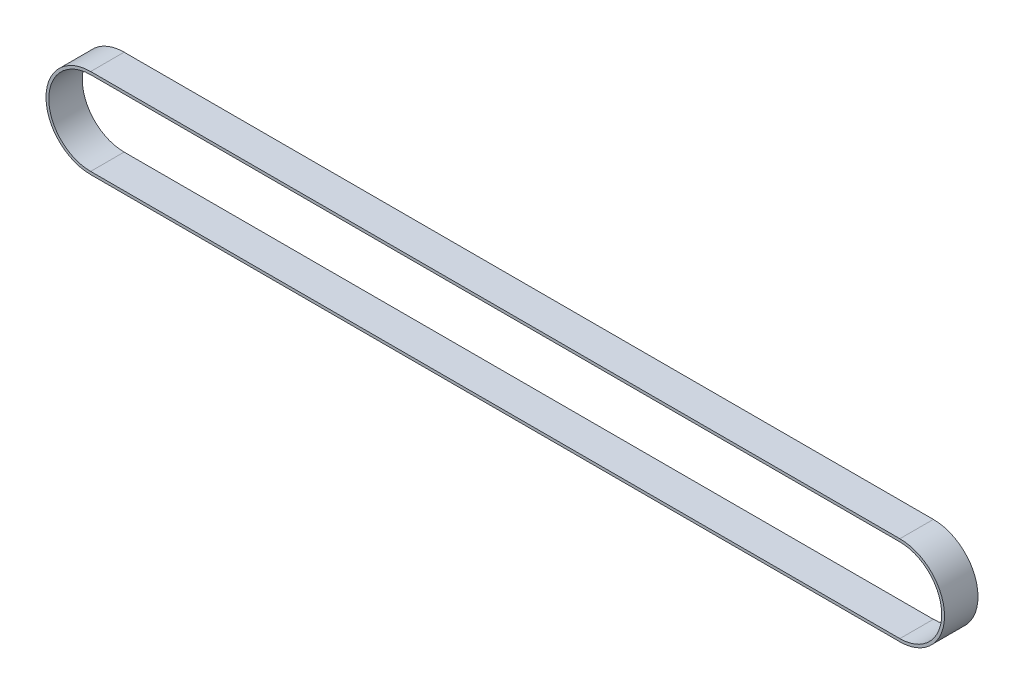
ISO-10303-21;
HEADER;
FILE_DESCRIPTION(('STEP AP214'),'2;1');
FILE_NAME('part.step','',(''),(''),'','','');
FILE_SCHEMA(('AUTOMOTIVE_DESIGN { 1 0 10303 214 1 1 1 1 }'));
ENDSEC;
DATA;
#1=APPLICATION_CONTEXT('core data for automotive mechanical design processes');
#2=APPLICATION_PROTOCOL_DEFINITION('international standard','automotive_design',2000,#1);
#3=PRODUCT_CONTEXT('',#1,'mechanical');
#4=PRODUCT('Part','Part','',(#3));
#5=PRODUCT_RELATED_PRODUCT_CATEGORY('part','',(#4));
#6=PRODUCT_DEFINITION_FORMATION('','',#4);
#7=PRODUCT_DEFINITION_CONTEXT('part definition',#1,'design');
#8=PRODUCT_DEFINITION('design','',#6,#7);
#9=PRODUCT_DEFINITION_SHAPE('','',#8);
#10=(LENGTH_UNIT() NAMED_UNIT(*) SI_UNIT(.MILLI.,.METRE.));
#11=(NAMED_UNIT(*) PLANE_ANGLE_UNIT() SI_UNIT($,.RADIAN.));
#12=(NAMED_UNIT(*) SI_UNIT($,.STERADIAN.) SOLID_ANGLE_UNIT());
#13=UNCERTAINTY_MEASURE_WITH_UNIT(LENGTH_MEASURE(1.E-05),#10,'distance_accuracy_value','');
#14=(GEOMETRIC_REPRESENTATION_CONTEXT(3) GLOBAL_UNCERTAINTY_ASSIGNED_CONTEXT((#13)) GLOBAL_UNIT_ASSIGNED_CONTEXT((#10,
#11,#12)) REPRESENTATION_CONTEXT('',''));
#15=CARTESIAN_POINT('',(0.,0.,0.));
#16=DIRECTION('',(0.,0.,1.));
#17=DIRECTION('',(1.,0.,0.));
#18=AXIS2_PLACEMENT_3D('',#15,#16,#17);
#19=CARTESIAN_POINT('',(0.,-0.500000000000014,-6.5));
#20=DIRECTION('',(0.,0.,1.));
#21=DIRECTION('',(1.,0.,0.));
#22=AXIS2_PLACEMENT_3D('',#19,#20,#21);
#23=CYLINDRICAL_SURFACE('',#22,8.);
#24=CARTESIAN_POINT('',(0.,-0.500000000000014,-0.5));
#25=DIRECTION('',(0.,0.,-1.));
#26=DIRECTION('',(-1.,0.,0.));
#27=AXIS2_PLACEMENT_3D('',#24,#25,#26);
#28=CIRCLE('',#27,8.);
#29=CARTESIAN_POINT('',(0.,7.49999999999999,-0.5));
#30=VERTEX_POINT('',#29);
#31=CARTESIAN_POINT('',(0.,-8.50000000000001,-0.5));
#32=VERTEX_POINT('',#31);
#33=EDGE_CURVE('E155',#30,#32,#28,.F.);
#34=ORIENTED_EDGE('',*,*,#33,.F.);
#35=DIRECTION('',(0.,0.,1.));
#36=VECTOR('',#35,1.);
#37=CARTESIAN_POINT('',(0.,7.49999999999999,-6.5));
#38=LINE('',#37,#36);
#39=CARTESIAN_POINT('',(0.,7.49999999999999,-6.5));
#40=VERTEX_POINT('',#39);
#41=EDGE_CURVE('E12',#40,#30,#38,.T.);
#42=ORIENTED_EDGE('',*,*,#41,.F.);
#43=CARTESIAN_POINT('',(0.,-0.500000000000014,-6.5));
#44=DIRECTION('',(0.,0.,-1.));
#45=DIRECTION('',(-1.,0.,0.));
#46=AXIS2_PLACEMENT_3D('',#43,#44,#45);
#47=CIRCLE('',#46,8.);
#48=CARTESIAN_POINT('',(0.,-8.50000000000001,-6.5));
#49=VERTEX_POINT('',#48);
#50=EDGE_CURVE('E159',#40,#49,#47,.F.);
#51=ORIENTED_EDGE('',*,*,#50,.T.);
#52=DIRECTION('',(0.,0.,1.));
#53=VECTOR('',#52,1.);
#54=CARTESIAN_POINT('',(0.,-8.50000000000001,-6.5));
#55=LINE('',#54,#53);
#56=EDGE_CURVE('E60',#49,#32,#55,.T.);
#57=ORIENTED_EDGE('',*,*,#56,.T.);
#58=EDGE_LOOP('',(#34,#42,#51,#57));
#59=FACE_BOUND('',#58,.T.);
#60=ADVANCED_FACE('F57',(#59),#23,.T.);
#61=CARTESIAN_POINT('',(0.,7.49999999999999,-6.5));
#62=DIRECTION('',(0.,1.,0.));
#63=DIRECTION('',(-1.,0.,0.));
#64=AXIS2_PLACEMENT_3D('',#61,#62,#63);
#65=PLANE('',#64);
#66=DIRECTION('',(-1.,0.,0.));
#67=VECTOR('',#66,1.);
#68=CARTESIAN_POINT('',(0.,7.49999999999999,-0.5));
#69=LINE('',#68,#67);
#70=CARTESIAN_POINT('',(145.,7.49999999999997,-0.5));
#71=VERTEX_POINT('',#70);
#72=EDGE_CURVE('E163',#71,#30,#69,.T.);
#73=ORIENTED_EDGE('',*,*,#72,.F.);
#74=DIRECTION('',(0.,0.,1.));
#75=VECTOR('',#74,1.);
#76=CARTESIAN_POINT('',(145.,7.49999999999997,-6.5));
#77=LINE('',#76,#75);
#78=CARTESIAN_POINT('',(145.,7.49999999999997,-6.5));
#79=VERTEX_POINT('',#78);
#80=EDGE_CURVE('E65',#79,#71,#77,.T.);
#81=ORIENTED_EDGE('',*,*,#80,.F.);
#82=DIRECTION('',(-1.,0.,0.));
#83=VECTOR('',#82,1.);
#84=CARTESIAN_POINT('',(0.,7.49999999999999,-6.5));
#85=LINE('',#84,#83);
#86=EDGE_CURVE('E169',#79,#40,#85,.T.);
#87=ORIENTED_EDGE('',*,*,#86,.T.);
#88=ORIENTED_EDGE('',*,*,#41,.T.);
#89=EDGE_LOOP('',(#73,#81,#87,#88));
#90=FACE_BOUND('',#89,.T.);
#91=ADVANCED_FACE('F195',(#90),#65,.T.);
#92=CARTESIAN_POINT('',(145.,-0.500000000000028,-6.5));
#93=DIRECTION('',(0.,0.,1.));
#94=DIRECTION('',(1.,0.,0.));
#95=AXIS2_PLACEMENT_3D('',#92,#93,#94);
#96=CYLINDRICAL_SURFACE('',#95,8.);
#97=CARTESIAN_POINT('',(145.,-0.500000000000028,-0.5));
#98=DIRECTION('',(0.,0.,-1.));
#99=DIRECTION('',(-1.,0.,0.));
#100=AXIS2_PLACEMENT_3D('',#97,#98,#99);
#101=CIRCLE('',#100,8.);
#102=CARTESIAN_POINT('',(145.,-8.50000000000003,-0.5));
#103=VERTEX_POINT('',#102);
#104=EDGE_CURVE('E177',#103,#71,#101,.F.);
#105=ORIENTED_EDGE('',*,*,#104,.F.);
#106=DIRECTION('',(0.,0.,1.));
#107=VECTOR('',#106,1.);
#108=CARTESIAN_POINT('',(145.,-8.50000000000003,-6.5));
#109=LINE('',#108,#107);
#110=CARTESIAN_POINT('',(145.,-8.50000000000003,-6.5));
#111=VERTEX_POINT('',#110);
#112=EDGE_CURVE('E182',#111,#103,#109,.T.);
#113=ORIENTED_EDGE('',*,*,#112,.F.);
#114=CARTESIAN_POINT('',(145.,-0.500000000000028,-6.5));
#115=DIRECTION('',(0.,0.,-1.));
#116=DIRECTION('',(-1.,0.,0.));
#117=AXIS2_PLACEMENT_3D('',#114,#115,#116);
#118=CIRCLE('',#117,8.);
#119=EDGE_CURVE('E166',#111,#79,#118,.F.);
#120=ORIENTED_EDGE('',*,*,#119,.T.);
#121=ORIENTED_EDGE('',*,*,#80,.T.);
#122=EDGE_LOOP('',(#105,#113,#120,#121));
#123=FACE_BOUND('',#122,.T.);
#124=ADVANCED_FACE('F199',(#123),#96,.T.);
#125=CARTESIAN_POINT('',(0.,-8.50000000000001,-6.5));
#126=DIRECTION('',(0.,-1.,0.));
#127=DIRECTION('',(1.,0.,0.));
#128=AXIS2_PLACEMENT_3D('',#125,#126,#127);
#129=PLANE('',#128);
#130=DIRECTION('',(1.,0.,0.));
#131=VECTOR('',#130,1.);
#132=CARTESIAN_POINT('',(0.,-8.50000000000001,-0.5));
#133=LINE('',#132,#131);
#134=EDGE_CURVE('E174',#32,#103,#133,.T.);
#135=ORIENTED_EDGE('',*,*,#134,.F.);
#136=ORIENTED_EDGE('',*,*,#56,.F.);
#137=DIRECTION('',(1.,0.,0.));
#138=VECTOR('',#137,1.);
#139=CARTESIAN_POINT('',(0.,-8.50000000000001,-6.5));
#140=LINE('',#139,#138);
#141=EDGE_CURVE('E162',#49,#111,#140,.T.);
#142=ORIENTED_EDGE('',*,*,#141,.T.);
#143=ORIENTED_EDGE('',*,*,#112,.T.);
#144=EDGE_LOOP('',(#135,#136,#142,#143));
#145=FACE_BOUND('',#144,.T.);
#146=ADVANCED_FACE('F190',(#145),#129,.T.);
#147=CARTESIAN_POINT('',(0.,-0.500000000000014,-6.5));
#148=DIRECTION('',(0.,0.,-1.));
#149=DIRECTION('',(-1.,0.,0.));
#150=AXIS2_PLACEMENT_3D('',#147,#148,#149);
#151=PLANE('',#150);
#152=CARTESIAN_POINT('',(0.,-0.500000000000014,-6.5));
#153=DIRECTION('',(0.,0.,1.));
#154=DIRECTION('',(-1.,0.,0.));
#155=AXIS2_PLACEMENT_3D('',#152,#153,#154);
#156=CIRCLE('',#155,7.5);
#157=CARTESIAN_POINT('',(0.,6.99999999999999,-6.5));
#158=VERTEX_POINT('',#157);
#159=CARTESIAN_POINT('',(0.,-8.00000000000001,-6.5));
#160=VERTEX_POINT('',#159);
#161=EDGE_CURVE('E124',#158,#160,#156,.T.);
#162=ORIENTED_EDGE('',*,*,#161,.T.);
#163=DIRECTION('',(1.,0.,0.));
#164=VECTOR('',#163,1.);
#165=CARTESIAN_POINT('',(145.,-8.00000000000003,-6.5));
#166=LINE('',#165,#164);
#167=CARTESIAN_POINT('',(145.,-8.00000000000003,-6.5));
#168=VERTEX_POINT('',#167);
#169=EDGE_CURVE('E133',#160,#168,#166,.T.);
#170=ORIENTED_EDGE('',*,*,#169,.T.);
#171=CARTESIAN_POINT('',(145.,-0.500000000000028,-6.5));
#172=DIRECTION('',(0.,0.,1.));
#173=DIRECTION('',(-1.,0.,0.));
#174=AXIS2_PLACEMENT_3D('',#171,#172,#173);
#175=CIRCLE('',#174,7.5);
#176=CARTESIAN_POINT('',(145.,6.99999999999997,-6.5));
#177=VERTEX_POINT('',#176);
#178=EDGE_CURVE('E73',#168,#177,#175,.T.);
#179=ORIENTED_EDGE('',*,*,#178,.T.);
#180=DIRECTION('',(-1.,0.,0.));
#181=VECTOR('',#180,1.);
#182=CARTESIAN_POINT('',(0.,6.99999999999999,-6.5));
#183=LINE('',#182,#181);
#184=EDGE_CURVE('E130',#177,#158,#183,.T.);
#185=ORIENTED_EDGE('',*,*,#184,.T.);
#186=EDGE_LOOP('',(#162,#170,#179,#185));
#187=FACE_BOUND('',#186,.T.);
#188=ORIENTED_EDGE('',*,*,#50,.F.);
#189=ORIENTED_EDGE('',*,*,#86,.F.);
#190=ORIENTED_EDGE('',*,*,#119,.F.);
#191=ORIENTED_EDGE('',*,*,#141,.F.);
#192=EDGE_LOOP('',(#188,#189,#190,#191));
#193=FACE_BOUND('',#192,.T.);
#194=ADVANCED_FACE('F137',(#187,#193),#151,.T.);
#195=CARTESIAN_POINT('',(0.,-0.500000000000014,-0.5));
#196=DIRECTION('',(0.,0.,-1.));
#197=DIRECTION('',(-1.,0.,0.));
#198=AXIS2_PLACEMENT_3D('',#195,#196,#197);
#199=PLANE('',#198);
#200=DIRECTION('',(1.,0.,0.));
#201=VECTOR('',#200,1.);
#202=CARTESIAN_POINT('',(145.,-8.00000000000003,-0.5));
#203=LINE('',#202,#201);
#204=CARTESIAN_POINT('',(0.,-8.00000000000001,-0.5));
#205=VERTEX_POINT('',#204);
#206=CARTESIAN_POINT('',(145.,-8.00000000000003,-0.5));
#207=VERTEX_POINT('',#206);
#208=EDGE_CURVE('E149',#205,#207,#203,.T.);
#209=ORIENTED_EDGE('',*,*,#208,.F.);
#210=CARTESIAN_POINT('',(0.,-0.500000000000014,-0.5));
#211=DIRECTION('',(0.,0.,1.));
#212=DIRECTION('',(-1.,0.,0.));
#213=AXIS2_PLACEMENT_3D('',#210,#211,#212);
#214=CIRCLE('',#213,7.5);
#215=CARTESIAN_POINT('',(0.,6.99999999999999,-0.5));
#216=VERTEX_POINT('',#215);
#217=EDGE_CURVE('E81',#216,#205,#214,.T.);
#218=ORIENTED_EDGE('',*,*,#217,.F.);
#219=DIRECTION('',(-1.,0.,0.));
#220=VECTOR('',#219,1.);
#221=CARTESIAN_POINT('',(0.,6.99999999999999,-0.5));
#222=LINE('',#221,#220);
#223=CARTESIAN_POINT('',(145.,6.99999999999997,-0.5));
#224=VERTEX_POINT('',#223);
#225=EDGE_CURVE('E140',#224,#216,#222,.T.);
#226=ORIENTED_EDGE('',*,*,#225,.F.);
#227=CARTESIAN_POINT('',(145.,-0.500000000000028,-0.5));
#228=DIRECTION('',(0.,0.,1.));
#229=DIRECTION('',(-1.,0.,0.));
#230=AXIS2_PLACEMENT_3D('',#227,#228,#229);
#231=CIRCLE('',#230,7.5);
#232=EDGE_CURVE('E143',#207,#224,#231,.T.);
#233=ORIENTED_EDGE('',*,*,#232,.F.);
#234=EDGE_LOOP('',(#209,#218,#226,#233));
#235=FACE_BOUND('',#234,.T.);
#236=ORIENTED_EDGE('',*,*,#33,.T.);
#237=ORIENTED_EDGE('',*,*,#134,.T.);
#238=ORIENTED_EDGE('',*,*,#104,.T.);
#239=ORIENTED_EDGE('',*,*,#72,.T.);
#240=EDGE_LOOP('',(#236,#237,#238,#239));
#241=FACE_BOUND('',#240,.T.);
#242=ADVANCED_FACE('F192',(#235,#241),#199,.F.);
#243=CARTESIAN_POINT('',(0.,-0.500000000000014,-6.5));
#244=DIRECTION('',(0.,0.,1.));
#245=DIRECTION('',(1.,0.,0.));
#246=AXIS2_PLACEMENT_3D('',#243,#244,#245);
#247=CYLINDRICAL_SURFACE('',#246,7.5);
#248=ORIENTED_EDGE('',*,*,#217,.T.);
#249=DIRECTION('',(0.,0.,1.));
#250=VECTOR('',#249,1.);
#251=CARTESIAN_POINT('',(0.,-8.00000000000001,-6.5));
#252=LINE('',#251,#250);
#253=EDGE_CURVE('E120',#160,#205,#252,.T.);
#254=ORIENTED_EDGE('',*,*,#253,.F.);
#255=ORIENTED_EDGE('',*,*,#161,.F.);
#256=DIRECTION('',(0.,0.,1.));
#257=VECTOR('',#256,1.);
#258=CARTESIAN_POINT('',(0.,6.99999999999999,-6.5));
#259=LINE('',#258,#257);
#260=EDGE_CURVE('E153',#158,#216,#259,.T.);
#261=ORIENTED_EDGE('',*,*,#260,.T.);
#262=EDGE_LOOP('',(#248,#254,#255,#261));
#263=FACE_BOUND('',#262,.T.);
#264=ADVANCED_FACE('F122',(#263),#247,.F.);
#265=CARTESIAN_POINT('',(0.,6.99999999999999,-6.5));
#266=DIRECTION('',(0.,1.,0.));
#267=DIRECTION('',(-1.,0.,0.));
#268=AXIS2_PLACEMENT_3D('',#265,#266,#267);
#269=PLANE('',#268);
#270=ORIENTED_EDGE('',*,*,#225,.T.);
#271=ORIENTED_EDGE('',*,*,#260,.F.);
#272=ORIENTED_EDGE('',*,*,#184,.F.);
#273=DIRECTION('',(0.,0.,1.));
#274=VECTOR('',#273,1.);
#275=CARTESIAN_POINT('',(145.,6.99999999999997,-6.5));
#276=LINE('',#275,#274);
#277=EDGE_CURVE('E156',#177,#224,#276,.T.);
#278=ORIENTED_EDGE('',*,*,#277,.T.);
#279=EDGE_LOOP('',(#270,#271,#272,#278));
#280=FACE_BOUND('',#279,.T.);
#281=ADVANCED_FACE('F250',(#280),#269,.F.);
#282=CARTESIAN_POINT('',(145.,-0.500000000000028,-6.5));
#283=DIRECTION('',(0.,0.,1.));
#284=DIRECTION('',(1.,0.,0.));
#285=AXIS2_PLACEMENT_3D('',#282,#283,#284);
#286=CYLINDRICAL_SURFACE('',#285,7.5);
#287=ORIENTED_EDGE('',*,*,#232,.T.);
#288=ORIENTED_EDGE('',*,*,#277,.F.);
#289=ORIENTED_EDGE('',*,*,#178,.F.);
#290=DIRECTION('',(0.,0.,1.));
#291=VECTOR('',#290,1.);
#292=CARTESIAN_POINT('',(145.,-8.00000000000003,-6.5));
#293=LINE('',#292,#291);
#294=EDGE_CURVE('E129',#168,#207,#293,.T.);
#295=ORIENTED_EDGE('',*,*,#294,.T.);
#296=EDGE_LOOP('',(#287,#288,#289,#295));
#297=FACE_BOUND('',#296,.T.);
#298=ADVANCED_FACE('F259',(#297),#286,.F.);
#299=CARTESIAN_POINT('',(145.,-8.00000000000003,-6.5));
#300=DIRECTION('',(0.,-1.,0.));
#301=DIRECTION('',(1.,0.,0.));
#302=AXIS2_PLACEMENT_3D('',#299,#300,#301);
#303=PLANE('',#302);
#304=ORIENTED_EDGE('',*,*,#208,.T.);
#305=ORIENTED_EDGE('',*,*,#294,.F.);
#306=ORIENTED_EDGE('',*,*,#169,.F.);
#307=ORIENTED_EDGE('',*,*,#253,.T.);
#308=EDGE_LOOP('',(#304,#305,#306,#307));
#309=FACE_BOUND('',#308,.T.);
#310=ADVANCED_FACE('F134',(#309),#303,.F.);
#311=CLOSED_SHELL('',(#60,#91,#124,#146,#194,#242,#264,#281,#298,#310));
#312=MANIFOLD_SOLID_BREP('B2',#311);
#313=ADVANCED_BREP_SHAPE_REPRESENTATION('',(#18,#312),#14);
#314=SHAPE_DEFINITION_REPRESENTATION(#9,#313);
ENDSEC;
END-ISO-10303-21;
